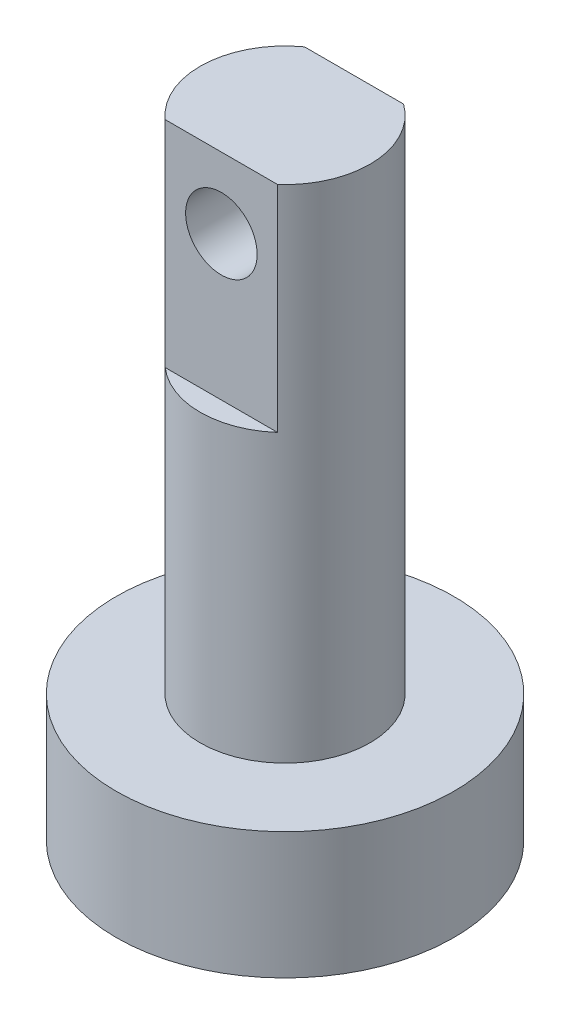
ISO-10303-21;
HEADER;
FILE_DESCRIPTION(('STEP AP214'),'2;1');
FILE_NAME('part.step','',(''),(''),'','','');
FILE_SCHEMA(('AUTOMOTIVE_DESIGN { 1 0 10303 214 1 1 1 1 }'));
ENDSEC;
DATA;
#1=APPLICATION_CONTEXT('core data for automotive mechanical design processes');
#2=APPLICATION_PROTOCOL_DEFINITION('international standard','automotive_design',2000,#1);
#3=PRODUCT_CONTEXT('',#1,'mechanical');
#4=PRODUCT('Part','Part','',(#3));
#5=PRODUCT_RELATED_PRODUCT_CATEGORY('part','',(#4));
#6=PRODUCT_DEFINITION_FORMATION('','',#4);
#7=PRODUCT_DEFINITION_CONTEXT('part definition',#1,'design');
#8=PRODUCT_DEFINITION('design','',#6,#7);
#9=PRODUCT_DEFINITION_SHAPE('','',#8);
#10=(LENGTH_UNIT() NAMED_UNIT(*) SI_UNIT(.MILLI.,.METRE.));
#11=(NAMED_UNIT(*) PLANE_ANGLE_UNIT() SI_UNIT($,.RADIAN.));
#12=(NAMED_UNIT(*) SI_UNIT($,.STERADIAN.) SOLID_ANGLE_UNIT());
#13=UNCERTAINTY_MEASURE_WITH_UNIT(LENGTH_MEASURE(1.E-05),#10,'distance_accuracy_value','');
#14=(GEOMETRIC_REPRESENTATION_CONTEXT(3) GLOBAL_UNCERTAINTY_ASSIGNED_CONTEXT((#13)) GLOBAL_UNIT_ASSIGNED_CONTEXT((#10,
#11,#12)) REPRESENTATION_CONTEXT('',''));
#15=CARTESIAN_POINT('',(0.,0.,0.));
#16=DIRECTION('',(0.,0.,1.));
#17=DIRECTION('',(1.,0.,0.));
#18=AXIS2_PLACEMENT_3D('',#15,#16,#17);
#19=CARTESIAN_POINT('',(0.,44.958,0.));
#20=DIRECTION('',(0.,-1.,0.));
#21=DIRECTION('',(0.,0.,-1.));
#22=AXIS2_PLACEMENT_3D('',#19,#20,#21);
#23=CYLINDRICAL_SURFACE('',#22,59.9105024341349);
#24=CARTESIAN_POINT('',(0.,44.958,0.));
#25=DIRECTION('',(0.,1.,0.));
#26=DIRECTION('',(0.,0.,1.));
#27=AXIS2_PLACEMENT_3D('',#24,#25,#26);
#28=CIRCLE('',#27,59.9105024341349);
#29=CARTESIAN_POINT('',(0.,44.958,59.9105024341349));
#30=VERTEX_POINT('',#29);
#31=EDGE_CURVE('E98',#30,#30,#28,.T.);
#32=ORIENTED_EDGE('',*,*,#31,.F.);
#33=EDGE_LOOP('',(#32));
#34=FACE_BOUND('',#33,.T.);
#35=CARTESIAN_POINT('',(0.,0.,0.));
#36=DIRECTION('',(0.,1.,0.));
#37=DIRECTION('',(0.,0.,1.));
#38=AXIS2_PLACEMENT_3D('',#35,#36,#37);
#39=CIRCLE('',#38,59.9105024341349);
#40=CARTESIAN_POINT('',(0.,0.,59.9105024341349));
#41=VERTEX_POINT('',#40);
#42=EDGE_CURVE('E94',#41,#41,#39,.T.);
#43=ORIENTED_EDGE('',*,*,#42,.T.);
#44=EDGE_LOOP('',(#43));
#45=FACE_BOUND('',#44,.T.);
#46=ADVANCED_FACE('F35',(#34,#45),#23,.T.);
#47=CARTESIAN_POINT('',(0.,44.958,0.));
#48=DIRECTION('',(0.,1.,0.));
#49=DIRECTION('',(0.,0.,1.));
#50=AXIS2_PLACEMENT_3D('',#47,#48,#49);
#51=PLANE('',#50);
#52=CARTESIAN_POINT('',(0.,44.958,0.));
#53=DIRECTION('',(0.,1.,0.));
#54=DIRECTION('',(0.,0.,1.));
#55=AXIS2_PLACEMENT_3D('',#52,#53,#54);
#56=CIRCLE('',#55,30.133554254694);
#57=CARTESIAN_POINT('',(0.,44.958,30.133554254694));
#58=VERTEX_POINT('',#57);
#59=EDGE_CURVE('E100',#58,#58,#56,.T.);
#60=ORIENTED_EDGE('',*,*,#59,.F.);
#61=EDGE_LOOP('',(#60));
#62=FACE_BOUND('',#61,.T.);
#63=ORIENTED_EDGE('',*,*,#31,.T.);
#64=EDGE_LOOP('',(#63));
#65=FACE_BOUND('',#64,.T.);
#66=ADVANCED_FACE('F139',(#62,#65),#51,.T.);
#67=CARTESIAN_POINT('',(0.,0.,0.));
#68=DIRECTION('',(0.,1.,0.));
#69=DIRECTION('',(0.,0.,1.));
#70=AXIS2_PLACEMENT_3D('',#67,#68,#69);
#71=PLANE('',#70);
#72=ORIENTED_EDGE('',*,*,#42,.F.);
#73=EDGE_LOOP('',(#72));
#74=FACE_BOUND('',#73,.T.);
#75=ADVANCED_FACE('F144',(#74),#71,.F.);
#76=CARTESIAN_POINT('',(0.,222.758,0.));
#77=DIRECTION('',(0.,-1.,0.));
#78=DIRECTION('',(0.,0.,-1.));
#79=AXIS2_PLACEMENT_3D('',#76,#77,#78);
#80=CYLINDRICAL_SURFACE('',#79,30.133554254694);
#81=CARTESIAN_POINT('',(0.,222.758,0.));
#82=DIRECTION('',(0.,1.,0.));
#83=DIRECTION('',(0.,0.,1.));
#84=AXIS2_PLACEMENT_3D('',#81,#82,#83);
#85=CIRCLE('',#84,30.133554254694);
#86=CARTESIAN_POINT('',(19.9373604089925,222.758,22.5949718287614));
#87=VERTEX_POINT('',#86);
#88=CARTESIAN_POINT('',(17.5722821644848,222.758,-24.4795014563678));
#89=VERTEX_POINT('',#88);
#90=EDGE_CURVE('E95',#87,#89,#85,.T.);
#91=ORIENTED_EDGE('',*,*,#90,.F.);
#92=DIRECTION('',(0.,-1.,0.));
#93=VECTOR('',#92,1.);
#94=CARTESIAN_POINT('',(19.9373604089925,222.758,22.5949718287614));
#95=LINE('',#94,#93);
#96=CARTESIAN_POINT('',(19.9373604089925,146.558,22.5949718287614));
#97=VERTEX_POINT('',#96);
#98=EDGE_CURVE('E50',#87,#97,#95,.T.);
#99=ORIENTED_EDGE('',*,*,#98,.T.);
#100=CARTESIAN_POINT('',(0.,146.558,0.));
#101=DIRECTION('',(0.,1.,0.));
#102=DIRECTION('',(0.,0.,1.));
#103=AXIS2_PLACEMENT_3D('',#100,#101,#102);
#104=CIRCLE('',#103,30.133554254694);
#105=CARTESIAN_POINT('',(-19.9373604089925,146.558,22.5949718287614));
#106=VERTEX_POINT('',#105);
#107=EDGE_CURVE('E11',#106,#97,#104,.T.);
#108=ORIENTED_EDGE('',*,*,#107,.F.);
#109=DIRECTION('',(0.,-1.,0.));
#110=VECTOR('',#109,1.);
#111=CARTESIAN_POINT('',(-19.9373604089925,222.758,22.5949718287614));
#112=LINE('',#111,#110);
#113=CARTESIAN_POINT('',(-19.9373604089925,222.758,22.5949718287614));
#114=VERTEX_POINT('',#113);
#115=EDGE_CURVE('E77',#106,#114,#112,.F.);
#116=ORIENTED_EDGE('',*,*,#115,.T.);
#117=CARTESIAN_POINT('',(-17.5722821644848,222.758,-24.4795014563678));
#118=VERTEX_POINT('',#117);
#119=EDGE_CURVE('E89',#118,#114,#85,.T.);
#120=ORIENTED_EDGE('',*,*,#119,.F.);
#121=DIRECTION('',(0.,-1.,0.));
#122=VECTOR('',#121,1.);
#123=CARTESIAN_POINT('',(-17.5722821644848,222.758,-24.4795014563678));
#124=LINE('',#123,#122);
#125=CARTESIAN_POINT('',(-17.5722821644848,146.558,-24.4795014563678));
#126=VERTEX_POINT('',#125);
#127=EDGE_CURVE('E58',#118,#126,#124,.T.);
#128=ORIENTED_EDGE('',*,*,#127,.T.);
#129=CARTESIAN_POINT('',(0.,146.558,0.));
#130=DIRECTION('',(0.,1.,0.));
#131=DIRECTION('',(0.,0.,1.));
#132=AXIS2_PLACEMENT_3D('',#129,#130,#131);
#133=CIRCLE('',#132,30.133554254694);
#134=CARTESIAN_POINT('',(17.5722821644848,146.558,-24.4795014563678));
#135=VERTEX_POINT('',#134);
#136=EDGE_CURVE('E82',#135,#126,#133,.T.);
#137=ORIENTED_EDGE('',*,*,#136,.F.);
#138=DIRECTION('',(0.,-1.,0.));
#139=VECTOR('',#138,1.);
#140=CARTESIAN_POINT('',(17.5722821644848,222.758,-24.4795014563678));
#141=LINE('',#140,#139);
#142=EDGE_CURVE('E116',#135,#89,#141,.F.);
#143=ORIENTED_EDGE('',*,*,#142,.T.);
#144=EDGE_LOOP('',(#91,#99,#108,#116,#120,#128,#137,#143));
#145=FACE_BOUND('',#144,.T.);
#146=ORIENTED_EDGE('',*,*,#59,.T.);
#147=EDGE_LOOP('',(#146));
#148=FACE_BOUND('',#147,.T.);
#149=ADVANCED_FACE('F87',(#145,#148),#80,.T.);
#150=CARTESIAN_POINT('',(0.,222.758,0.));
#151=DIRECTION('',(0.,1.,0.));
#152=DIRECTION('',(0.,0.,1.));
#153=AXIS2_PLACEMENT_3D('',#150,#151,#152);
#154=PLANE('',#153);
#155=DIRECTION('',(-1.,0.,0.));
#156=VECTOR('',#155,1.);
#157=CARTESIAN_POINT('',(0.,222.758,22.5949718287614));
#158=LINE('',#157,#156);
#159=EDGE_CURVE('E43',#87,#114,#158,.T.);
#160=ORIENTED_EDGE('',*,*,#159,.F.);
#161=ORIENTED_EDGE('',*,*,#90,.T.);
#162=DIRECTION('',(1.,0.,0.));
#163=VECTOR('',#162,1.);
#164=CARTESIAN_POINT('',(0.,222.758,-24.4795014563678));
#165=LINE('',#164,#163);
#166=EDGE_CURVE('E93',#118,#89,#165,.T.);
#167=ORIENTED_EDGE('',*,*,#166,.F.);
#168=ORIENTED_EDGE('',*,*,#119,.T.);
#169=EDGE_LOOP('',(#160,#161,#167,#168));
#170=FACE_BOUND('',#169,.T.);
#171=ADVANCED_FACE('F92',(#170),#154,.T.);
#172=CARTESIAN_POINT('',(0.,146.558,0.));
#173=DIRECTION('',(0.,1.,0.));
#174=DIRECTION('',(0.,0.,1.));
#175=AXIS2_PLACEMENT_3D('',#172,#173,#174);
#176=PLANE('',#175);
#177=ORIENTED_EDGE('',*,*,#136,.T.);
#178=DIRECTION('',(1.,0.,0.));
#179=VECTOR('',#178,1.);
#180=CARTESIAN_POINT('',(-27.2703240979724,146.558,-24.4795014563678));
#181=LINE('',#180,#179);
#182=EDGE_CURVE('E113',#126,#135,#181,.T.);
#183=ORIENTED_EDGE('',*,*,#182,.T.);
#184=EDGE_LOOP('',(#177,#183));
#185=FACE_BOUND('',#184,.T.);
#186=ADVANCED_FACE('F112',(#185),#176,.T.);
#187=CARTESIAN_POINT('',(-27.2703240979724,146.558,-24.4795014563678));
#188=DIRECTION('',(0.,0.,1.));
#189=DIRECTION('',(1.,0.,0.));
#190=AXIS2_PLACEMENT_3D('',#187,#188,#189);
#191=PLANE('',#190);
#192=CARTESIAN_POINT('',(0.,197.652270738644,-24.4795014563678));
#193=DIRECTION('',(0.,0.,-1.));
#194=DIRECTION('',(-1.,0.,0.));
#195=AXIS2_PLACEMENT_3D('',#192,#193,#194);
#196=CIRCLE('',#195,12.7);
#197=CARTESIAN_POINT('',(-12.7,197.652270738644,-24.4795014563678));
#198=VERTEX_POINT('',#197);
#199=EDGE_CURVE('E121',#198,#198,#196,.T.);
#200=ORIENTED_EDGE('',*,*,#199,.F.);
#201=EDGE_LOOP('',(#200));
#202=FACE_BOUND('',#201,.T.);
#203=ORIENTED_EDGE('',*,*,#166,.T.);
#204=ORIENTED_EDGE('',*,*,#142,.F.);
#205=ORIENTED_EDGE('',*,*,#182,.F.);
#206=ORIENTED_EDGE('',*,*,#127,.F.);
#207=EDGE_LOOP('',(#203,#204,#205,#206));
#208=FACE_BOUND('',#207,.T.);
#209=ADVANCED_FACE('F115',(#202,#208),#191,.F.);
#210=CARTESIAN_POINT('',(0.,146.558,0.));
#211=DIRECTION('',(0.,1.,0.));
#212=DIRECTION('',(0.,0.,1.));
#213=AXIS2_PLACEMENT_3D('',#210,#211,#212);
#214=PLANE('',#213);
#215=ORIENTED_EDGE('',*,*,#107,.T.);
#216=DIRECTION('',(-1.,0.,0.));
#217=VECTOR('',#216,1.);
#218=CARTESIAN_POINT('',(-27.2703240979724,146.558,22.5949718287614));
#219=LINE('',#218,#217);
#220=EDGE_CURVE('E90',#97,#106,#219,.T.);
#221=ORIENTED_EDGE('',*,*,#220,.T.);
#222=EDGE_LOOP('',(#215,#221));
#223=FACE_BOUND('',#222,.T.);
#224=ADVANCED_FACE('F135',(#223),#214,.T.);
#225=CARTESIAN_POINT('',(-27.2703240979724,146.558,22.5949718287614));
#226=DIRECTION('',(0.,0.,-1.));
#227=DIRECTION('',(-1.,0.,0.));
#228=AXIS2_PLACEMENT_3D('',#225,#226,#227);
#229=PLANE('',#228);
#230=CARTESIAN_POINT('',(0.,197.652270738644,22.5949718287614));
#231=DIRECTION('',(0.,0.,-1.));
#232=DIRECTION('',(-1.,0.,0.));
#233=AXIS2_PLACEMENT_3D('',#230,#231,#232);
#234=CIRCLE('',#233,12.7);
#235=CARTESIAN_POINT('',(-12.7,197.652270738644,22.5949718287614));
#236=VERTEX_POINT('',#235);
#237=EDGE_CURVE('E38',#236,#236,#234,.T.);
#238=ORIENTED_EDGE('',*,*,#237,.T.);
#239=EDGE_LOOP('',(#238));
#240=FACE_BOUND('',#239,.T.);
#241=ORIENTED_EDGE('',*,*,#159,.T.);
#242=ORIENTED_EDGE('',*,*,#115,.F.);
#243=ORIENTED_EDGE('',*,*,#220,.F.);
#244=ORIENTED_EDGE('',*,*,#98,.F.);
#245=EDGE_LOOP('',(#241,#242,#243,#244));
#246=FACE_BOUND('',#245,.T.);
#247=ADVANCED_FACE('F76',(#240,#246),#229,.F.);
#248=CARTESIAN_POINT('',(0.,197.652270738644,59.9105024341349));
#249=DIRECTION('',(0.,0.,-1.));
#250=DIRECTION('',(-1.,0.,0.));
#251=AXIS2_PLACEMENT_3D('',#248,#249,#250);
#252=CYLINDRICAL_SURFACE('',#251,12.7);
#253=ORIENTED_EDGE('',*,*,#199,.T.);
#254=EDGE_LOOP('',(#253));
#255=FACE_BOUND('',#254,.T.);
#256=ORIENTED_EDGE('',*,*,#237,.F.);
#257=EDGE_LOOP('',(#256));
#258=FACE_BOUND('',#257,.T.);
#259=ADVANCED_FACE('F129',(#255,#258),#252,.F.);
#260=CLOSED_SHELL('',(#46,#66,#75,#149,#171,#186,#209,#224,#247,#259));
#261=MANIFOLD_SOLID_BREP('B2',#260);
#262=ADVANCED_BREP_SHAPE_REPRESENTATION('',(#18,#261),#14);
#263=SHAPE_DEFINITION_REPRESENTATION(#9,#262);
ENDSEC;
END-ISO-10303-21;
